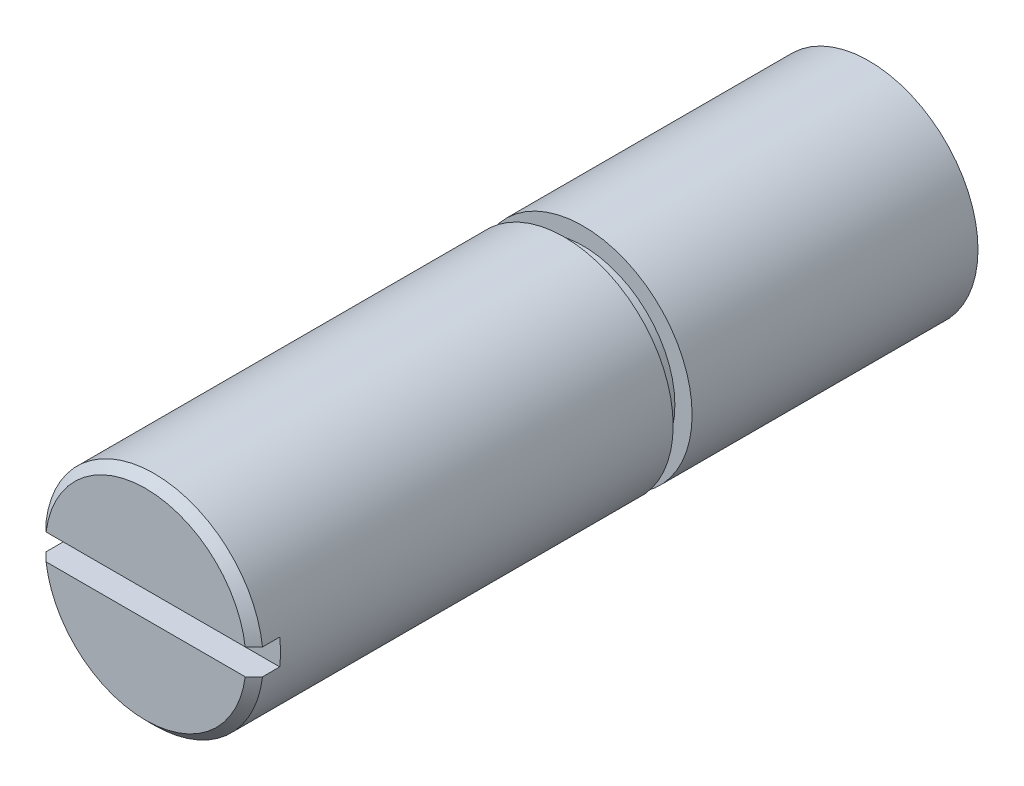
ISO-10303-21;
HEADER;
FILE_DESCRIPTION(('STEP AP214'),'2;1');
FILE_NAME('part.step','',(''),(''),'','','');
FILE_SCHEMA(('AUTOMOTIVE_DESIGN { 1 0 10303 214 1 1 1 1 }'));
ENDSEC;
DATA;
#1=APPLICATION_CONTEXT('core data for automotive mechanical design processes');
#2=APPLICATION_PROTOCOL_DEFINITION('international standard','automotive_design',2000,#1);
#3=PRODUCT_CONTEXT('',#1,'mechanical');
#4=PRODUCT('Part','Part','',(#3));
#5=PRODUCT_RELATED_PRODUCT_CATEGORY('part','',(#4));
#6=PRODUCT_DEFINITION_FORMATION('','',#4);
#7=PRODUCT_DEFINITION_CONTEXT('part definition',#1,'design');
#8=PRODUCT_DEFINITION('design','',#6,#7);
#9=PRODUCT_DEFINITION_SHAPE('','',#8);
#10=(LENGTH_UNIT() NAMED_UNIT(*) SI_UNIT(.MILLI.,.METRE.));
#11=(NAMED_UNIT(*) PLANE_ANGLE_UNIT() SI_UNIT($,.RADIAN.));
#12=(NAMED_UNIT(*) SI_UNIT($,.STERADIAN.) SOLID_ANGLE_UNIT());
#13=UNCERTAINTY_MEASURE_WITH_UNIT(LENGTH_MEASURE(1.E-05),#10,'distance_accuracy_value','');
#14=(GEOMETRIC_REPRESENTATION_CONTEXT(3) GLOBAL_UNCERTAINTY_ASSIGNED_CONTEXT((#13)) GLOBAL_UNIT_ASSIGNED_CONTEXT((#10,
#11,#12)) REPRESENTATION_CONTEXT('',''));
#15=CARTESIAN_POINT('',(0.,0.,0.));
#16=DIRECTION('',(0.,0.,1.));
#17=DIRECTION('',(1.,0.,0.));
#18=AXIS2_PLACEMENT_3D('',#15,#16,#17);
#19=CARTESIAN_POINT('',(0.,0.,0.));
#20=DIRECTION('',(0.,0.,-1.));
#21=DIRECTION('',(0.,-1.,0.));
#22=AXIS2_PLACEMENT_3D('',#19,#20,#21);
#23=PLANE('',#22);
#24=CARTESIAN_POINT('',(0.,0.,0.));
#25=DIRECTION('',(0.,0.,-1.));
#26=DIRECTION('',(-1.,0.,0.));
#27=AXIS2_PLACEMENT_3D('',#24,#25,#26);
#28=CIRCLE('',#27,3.165);
#29=CARTESIAN_POINT('',(3.165,0.,0.));
#30=VERTEX_POINT('',#29);
#31=EDGE_CURVE('E145',#30,#30,#28,.T.);
#32=ORIENTED_EDGE('',*,*,#31,.T.);
#33=EDGE_LOOP('',(#32));
#34=FACE_BOUND('',#33,.T.);
#35=ADVANCED_FACE('F16',(#34),#23,.T.);
#36=CARTESIAN_POINT('',(0.,0.,0.));
#37=DIRECTION('',(0.,0.,1.));
#38=DIRECTION('',(-1.,0.,0.));
#39=AXIS2_PLACEMENT_3D('',#36,#37,#38);
#40=CYLINDRICAL_SURFACE('',#39,3.165);
#41=DIRECTION('',(0.,0.,1.));
#42=VECTOR('',#41,1.);
#43=CARTESIAN_POINT('',(3.14270584051387,-0.375,20.25));
#44=LINE('',#43,#42);
#45=CARTESIAN_POINT('',(3.14270584051387,-0.375,20.25));
#46=VERTEX_POINT('',#45);
#47=CARTESIAN_POINT('',(3.14270584051387,-0.375,20.75));
#48=VERTEX_POINT('',#47);
#49=EDGE_CURVE('E101',#46,#48,#44,.T.);
#50=ORIENTED_EDGE('',*,*,#49,.T.);
#51=CARTESIAN_POINT('',(0.,0.,20.75));
#52=DIRECTION('',(0.,0.,1.));
#53=DIRECTION('',(-1.,0.,0.));
#54=AXIS2_PLACEMENT_3D('',#51,#52,#53);
#55=CIRCLE('',#54,3.165);
#56=CARTESIAN_POINT('',(-3.14270584051387,-0.375,20.75));
#57=VERTEX_POINT('',#56);
#58=EDGE_CURVE('E11',#57,#48,#55,.T.);
#59=ORIENTED_EDGE('',*,*,#58,.F.);
#60=DIRECTION('',(0.,0.,-1.));
#61=VECTOR('',#60,1.);
#62=CARTESIAN_POINT('',(-3.14270584051387,-0.375,20.75));
#63=LINE('',#62,#61);
#64=CARTESIAN_POINT('',(-3.14270584051387,-0.375,20.25));
#65=VERTEX_POINT('',#64);
#66=EDGE_CURVE('E98',#57,#65,#63,.T.);
#67=ORIENTED_EDGE('',*,*,#66,.T.);
#68=CARTESIAN_POINT('',(0.,0.,20.25));
#69=DIRECTION('',(0.,0.,-1.));
#70=DIRECTION('',(-1.,0.,0.));
#71=AXIS2_PLACEMENT_3D('',#68,#69,#70);
#72=CIRCLE('',#71,3.165);
#73=CARTESIAN_POINT('',(-3.14270584051387,0.375,20.25));
#74=VERTEX_POINT('',#73);
#75=EDGE_CURVE('E139',#65,#74,#72,.T.);
#76=ORIENTED_EDGE('',*,*,#75,.T.);
#77=DIRECTION('',(0.,0.,1.));
#78=VECTOR('',#77,1.);
#79=CARTESIAN_POINT('',(-3.14270584051387,0.375,20.25));
#80=LINE('',#79,#78);
#81=CARTESIAN_POINT('',(-3.14270584051387,0.375,20.75));
#82=VERTEX_POINT('',#81);
#83=EDGE_CURVE('E132',#74,#82,#80,.T.);
#84=ORIENTED_EDGE('',*,*,#83,.T.);
#85=CARTESIAN_POINT('',(0.,0.,20.75));
#86=DIRECTION('',(0.,0.,1.));
#87=DIRECTION('',(-1.,0.,0.));
#88=AXIS2_PLACEMENT_3D('',#85,#86,#87);
#89=CIRCLE('',#88,3.165);
#90=CARTESIAN_POINT('',(3.14270584051387,0.375,20.75));
#91=VERTEX_POINT('',#90);
#92=EDGE_CURVE('E27',#91,#82,#89,.T.);
#93=ORIENTED_EDGE('',*,*,#92,.F.);
#94=DIRECTION('',(0.,0.,-1.));
#95=VECTOR('',#94,1.);
#96=CARTESIAN_POINT('',(3.14270584051387,0.375,20.75));
#97=LINE('',#96,#95);
#98=CARTESIAN_POINT('',(3.14270584051387,0.375,20.25));
#99=VERTEX_POINT('',#98);
#100=EDGE_CURVE('E140',#91,#99,#97,.T.);
#101=ORIENTED_EDGE('',*,*,#100,.T.);
#102=CARTESIAN_POINT('',(0.,0.,20.25));
#103=DIRECTION('',(0.,0.,-1.));
#104=DIRECTION('',(-1.,0.,0.));
#105=AXIS2_PLACEMENT_3D('',#102,#103,#104);
#106=CIRCLE('',#105,3.165);
#107=EDGE_CURVE('E41',#99,#46,#106,.T.);
#108=ORIENTED_EDGE('',*,*,#107,.T.);
#109=EDGE_LOOP('',(#50,#59,#67,#76,#84,#93,#101,#108));
#110=FACE_BOUND('',#109,.T.);
#111=CARTESIAN_POINT('',(0.,0.,8.85));
#112=DIRECTION('',(0.,0.,1.));
#113=DIRECTION('',(-1.,0.,0.));
#114=AXIS2_PLACEMENT_3D('',#111,#112,#113);
#115=CIRCLE('',#114,3.165);
#116=CARTESIAN_POINT('',(3.165,0.,8.85));
#117=VERTEX_POINT('',#116);
#118=EDGE_CURVE('E146',#117,#117,#115,.T.);
#119=ORIENTED_EDGE('',*,*,#118,.T.);
#120=EDGE_LOOP('',(#119));
#121=FACE_BOUND('',#120,.T.);
#122=ADVANCED_FACE('F95',(#110,#121),#40,.T.);
#123=CARTESIAN_POINT('',(0.,0.,20.875));
#124=DIRECTION('',(0.,0.,-1.));
#125=DIRECTION('',(-1.,0.,0.));
#126=AXIS2_PLACEMENT_3D('',#123,#124,#125);
#127=CONICAL_SURFACE('',#126,3.04,0.785398162500002);
#128=CARTESIAN_POINT('',(3.14270584051388,-0.375,20.75));
#129=CARTESIAN_POINT('',(3.011562712765,-0.375,20.8802193597218));
#130=CARTESIAN_POINT('',(2.8907784418734,-0.375,21.));
#131=(BOUNDED_CURVE() B_SPLINE_CURVE(2,(#128,#129,#130),.UNSPECIFIED.,.F.,
.F.) B_SPLINE_CURVE_WITH_KNOTS((3,3),(0.,0.035491888845036),
.UNSPECIFIED.) CURVE() GEOMETRIC_REPRESENTATION_ITEM() RATIONAL_B_SPLINE_CURVE((1.,
1.0008595541965,1.)) REPRESENTATION_ITEM(''));
#132=CARTESIAN_POINT('',(2.8907784418734,-0.375,21.));
#133=VERTEX_POINT('',#132);
#134=EDGE_CURVE('E165',#48,#133,#131,.T.);
#135=ORIENTED_EDGE('',*,*,#134,.T.);
#136=CARTESIAN_POINT('',(0.,0.,21.));
#137=DIRECTION('',(0.,0.,-1.));
#138=DIRECTION('',(-1.,0.,0.));
#139=AXIS2_PLACEMENT_3D('',#136,#137,#138);
#140=CIRCLE('',#139,2.915);
#141=CARTESIAN_POINT('',(-2.8907784418734,-0.375,21.));
#142=VERTEX_POINT('',#141);
#143=EDGE_CURVE('E20',#133,#142,#140,.T.);
#144=ORIENTED_EDGE('',*,*,#143,.T.);
#145=CARTESIAN_POINT('',(-2.8907784418734,-0.375,21.));
#146=CARTESIAN_POINT('',(-3.011562712765,-0.375,20.8802193597218));
#147=CARTESIAN_POINT('',(-3.14270584051388,-0.375,20.75));
#148=(BOUNDED_CURVE() B_SPLINE_CURVE(2,(#145,#146,#147),.UNSPECIFIED.,.F.,
.F.) B_SPLINE_CURVE_WITH_KNOTS((3,3),(0.,0.035491888845036),
.UNSPECIFIED.) CURVE() GEOMETRIC_REPRESENTATION_ITEM() RATIONAL_B_SPLINE_CURVE((1.,
1.0008595541965,1.)) REPRESENTATION_ITEM(''));
#149=EDGE_CURVE('E106',#142,#57,#148,.T.);
#150=ORIENTED_EDGE('',*,*,#149,.T.);
#151=ORIENTED_EDGE('',*,*,#58,.T.);
#152=EDGE_LOOP('',(#135,#144,#150,#151));
#153=FACE_BOUND('',#152,.T.);
#154=ADVANCED_FACE('F107',(#153),#127,.T.);
#155=CARTESIAN_POINT('',(0.,0.,20.875));
#156=DIRECTION('',(0.,0.,-1.));
#157=DIRECTION('',(-1.,0.,0.));
#158=AXIS2_PLACEMENT_3D('',#155,#156,#157);
#159=CONICAL_SURFACE('',#158,3.04,0.785398162500002);
#160=CARTESIAN_POINT('',(2.8907784418734,0.375,21.));
#161=CARTESIAN_POINT('',(3.011562712765,0.375,20.8802193597218));
#162=CARTESIAN_POINT('',(3.14270584051388,0.375,20.75));
#163=(BOUNDED_CURVE() B_SPLINE_CURVE(2,(#160,#161,#162),.UNSPECIFIED.,.F.,
.F.) B_SPLINE_CURVE_WITH_KNOTS((3,3),(0.,0.035491888845036),
.UNSPECIFIED.) CURVE() GEOMETRIC_REPRESENTATION_ITEM() RATIONAL_B_SPLINE_CURVE((1.,
1.0008595541965,1.)) REPRESENTATION_ITEM(''));
#164=CARTESIAN_POINT('',(2.8907784418734,0.375,21.));
#165=VERTEX_POINT('',#164);
#166=EDGE_CURVE('E148',#165,#91,#163,.T.);
#167=ORIENTED_EDGE('',*,*,#166,.T.);
#168=ORIENTED_EDGE('',*,*,#92,.T.);
#169=CARTESIAN_POINT('',(-3.14270584051388,0.375,20.75));
#170=CARTESIAN_POINT('',(-3.011562712765,0.375,20.8802193597218));
#171=CARTESIAN_POINT('',(-2.8907784418734,0.375,21.));
#172=(BOUNDED_CURVE() B_SPLINE_CURVE(2,(#169,#170,#171),.UNSPECIFIED.,.F.,
.F.) B_SPLINE_CURVE_WITH_KNOTS((3,3),(0.,0.035491888845036),
.UNSPECIFIED.) CURVE() GEOMETRIC_REPRESENTATION_ITEM() RATIONAL_B_SPLINE_CURVE((1.,
1.0008595541965,1.)) REPRESENTATION_ITEM(''));
#173=CARTESIAN_POINT('',(-2.8907784418734,0.375,21.));
#174=VERTEX_POINT('',#173);
#175=EDGE_CURVE('E127',#82,#174,#172,.T.);
#176=ORIENTED_EDGE('',*,*,#175,.T.);
#177=CARTESIAN_POINT('',(0.,0.,21.));
#178=DIRECTION('',(0.,0.,-1.));
#179=DIRECTION('',(-1.,0.,0.));
#180=AXIS2_PLACEMENT_3D('',#177,#178,#179);
#181=CIRCLE('',#180,2.915);
#182=EDGE_CURVE('E64',#174,#165,#181,.T.);
#183=ORIENTED_EDGE('',*,*,#182,.T.);
#184=EDGE_LOOP('',(#167,#168,#176,#183));
#185=FACE_BOUND('',#184,.T.);
#186=ADVANCED_FACE('F295',(#185),#159,.T.);
#187=CARTESIAN_POINT('',(0.,0.,21.));
#188=DIRECTION('',(0.,0.,-1.));
#189=DIRECTION('',(0.,-1.,0.));
#190=AXIS2_PLACEMENT_3D('',#187,#188,#189);
#191=PLANE('',#190);
#192=DIRECTION('',(-1.,0.,0.));
#193=VECTOR('',#192,1.);
#194=CARTESIAN_POINT('',(2.8907784418734,-0.375,21.));
#195=LINE('',#194,#193);
#196=EDGE_CURVE('E112',#133,#142,#195,.T.);
#197=ORIENTED_EDGE('',*,*,#196,.T.);
#198=ORIENTED_EDGE('',*,*,#143,.F.);
#199=EDGE_LOOP('',(#197,#198));
#200=FACE_BOUND('',#199,.T.);
#201=ADVANCED_FACE('F285',(#200),#191,.F.);
#202=CARTESIAN_POINT('',(0.,0.,21.));
#203=DIRECTION('',(0.,0.,-1.));
#204=DIRECTION('',(0.,-1.,0.));
#205=AXIS2_PLACEMENT_3D('',#202,#203,#204);
#206=PLANE('',#205);
#207=DIRECTION('',(1.,0.,0.));
#208=VECTOR('',#207,1.);
#209=CARTESIAN_POINT('',(-2.8907784418734,0.375,21.));
#210=LINE('',#209,#208);
#211=EDGE_CURVE('E133',#174,#165,#210,.T.);
#212=ORIENTED_EDGE('',*,*,#211,.T.);
#213=ORIENTED_EDGE('',*,*,#182,.F.);
#214=EDGE_LOOP('',(#212,#213));
#215=FACE_BOUND('',#214,.T.);
#216=ADVANCED_FACE('F276',(#215),#206,.F.);
#217=CARTESIAN_POINT('',(0.,0.,20.25));
#218=DIRECTION('',(0.,0.,1.));
#219=DIRECTION('',(1.,0.,0.));
#220=AXIS2_PLACEMENT_3D('',#217,#218,#219);
#221=PLANE('',#220);
#222=DIRECTION('',(1.,0.,0.));
#223=VECTOR('',#222,1.);
#224=CARTESIAN_POINT('',(-3.14270584051387,-0.375,20.25));
#225=LINE('',#224,#223);
#226=EDGE_CURVE('E115',#65,#46,#225,.T.);
#227=ORIENTED_EDGE('',*,*,#226,.T.);
#228=ORIENTED_EDGE('',*,*,#107,.F.);
#229=DIRECTION('',(-1.,0.,0.));
#230=VECTOR('',#229,1.);
#231=CARTESIAN_POINT('',(3.14270584051387,0.375,20.25));
#232=LINE('',#231,#230);
#233=EDGE_CURVE('E125',#99,#74,#232,.T.);
#234=ORIENTED_EDGE('',*,*,#233,.T.);
#235=ORIENTED_EDGE('',*,*,#75,.F.);
#236=EDGE_LOOP('',(#227,#228,#234,#235));
#237=FACE_BOUND('',#236,.T.);
#238=ADVANCED_FACE('F265',(#237),#221,.T.);
#239=CARTESIAN_POINT('',(3.14270584051387,0.375,21.));
#240=DIRECTION('',(0.,1.,0.));
#241=DIRECTION('',(1.,0.,0.));
#242=AXIS2_PLACEMENT_3D('',#239,#240,#241);
#243=PLANE('',#242);
#244=ORIENTED_EDGE('',*,*,#166,.F.);
#245=ORIENTED_EDGE('',*,*,#211,.F.);
#246=ORIENTED_EDGE('',*,*,#175,.F.);
#247=ORIENTED_EDGE('',*,*,#83,.F.);
#248=ORIENTED_EDGE('',*,*,#233,.F.);
#249=ORIENTED_EDGE('',*,*,#100,.F.);
#250=EDGE_LOOP('',(#244,#245,#246,#247,#248,#249));
#251=FACE_BOUND('',#250,.T.);
#252=ADVANCED_FACE('F254',(#251),#243,.F.);
#253=CARTESIAN_POINT('',(-3.14270584051387,-0.375,21.));
#254=DIRECTION('',(0.,-1.,0.));
#255=DIRECTION('',(0.,0.,-1.));
#256=AXIS2_PLACEMENT_3D('',#253,#254,#255);
#257=PLANE('',#256);
#258=ORIENTED_EDGE('',*,*,#134,.F.);
#259=ORIENTED_EDGE('',*,*,#49,.F.);
#260=ORIENTED_EDGE('',*,*,#226,.F.);
#261=ORIENTED_EDGE('',*,*,#66,.F.);
#262=ORIENTED_EDGE('',*,*,#149,.F.);
#263=ORIENTED_EDGE('',*,*,#196,.F.);
#264=EDGE_LOOP('',(#258,#259,#260,#261,#262,#263));
#265=FACE_BOUND('',#264,.T.);
#266=ADVANCED_FACE('F114',(#265),#257,.F.);
#267=CARTESIAN_POINT('',(0.,0.,0.));
#268=DIRECTION('',(0.,0.,1.));
#269=DIRECTION('',(-1.,0.,0.));
#270=AXIS2_PLACEMENT_3D('',#267,#268,#269);
#271=CYLINDRICAL_SURFACE('',#270,3.165);
#272=CARTESIAN_POINT('',(0.,0.,8.3));
#273=DIRECTION('',(0.,0.,-1.));
#274=DIRECTION('',(-1.,0.,0.));
#275=AXIS2_PLACEMENT_3D('',#272,#273,#274);
#276=CIRCLE('',#275,3.165);
#277=CARTESIAN_POINT('',(3.165,0.,8.3));
#278=VERTEX_POINT('',#277);
#279=EDGE_CURVE('E141',#278,#278,#276,.T.);
#280=ORIENTED_EDGE('',*,*,#279,.T.);
#281=EDGE_LOOP('',(#280));
#282=FACE_BOUND('',#281,.T.);
#283=ORIENTED_EDGE('',*,*,#31,.F.);
#284=EDGE_LOOP('',(#283));
#285=FACE_BOUND('',#284,.T.);
#286=ADVANCED_FACE('F18',(#282,#285),#271,.T.);
#287=CARTESIAN_POINT('',(0.,0.,8.3));
#288=DIRECTION('',(0.,0.,-1.));
#289=DIRECTION('',(0.,-1.,0.));
#290=AXIS2_PLACEMENT_3D('',#287,#288,#289);
#291=PLANE('',#290);
#292=CARTESIAN_POINT('',(0.,0.,8.3));
#293=DIRECTION('',(0.,0.,1.));
#294=DIRECTION('',(-1.,0.,0.));
#295=AXIS2_PLACEMENT_3D('',#292,#293,#294);
#296=CIRCLE('',#295,2.665);
#297=CARTESIAN_POINT('',(2.665,0.,8.3));
#298=VERTEX_POINT('',#297);
#299=EDGE_CURVE('E152',#298,#298,#296,.T.);
#300=ORIENTED_EDGE('',*,*,#299,.F.);
#301=EDGE_LOOP('',(#300));
#302=FACE_BOUND('',#301,.T.);
#303=ORIENTED_EDGE('',*,*,#279,.F.);
#304=EDGE_LOOP('',(#303));
#305=FACE_BOUND('',#304,.T.);
#306=ADVANCED_FACE('F222',(#302,#305),#291,.F.);
#307=CARTESIAN_POINT('',(0.,0.,8.85));
#308=DIRECTION('',(0.,0.,-1.));
#309=DIRECTION('',(0.,-1.,0.));
#310=AXIS2_PLACEMENT_3D('',#307,#308,#309);
#311=PLANE('',#310);
#312=CARTESIAN_POINT('',(0.,0.,8.85));
#313=DIRECTION('',(0.,0.,-1.));
#314=DIRECTION('',(-1.,0.,0.));
#315=AXIS2_PLACEMENT_3D('',#312,#313,#314);
#316=CIRCLE('',#315,2.665);
#317=CARTESIAN_POINT('',(2.665,0.,8.85));
#318=VERTEX_POINT('',#317);
#319=EDGE_CURVE('E159',#318,#318,#316,.T.);
#320=ORIENTED_EDGE('',*,*,#319,.F.);
#321=EDGE_LOOP('',(#320));
#322=FACE_BOUND('',#321,.T.);
#323=ORIENTED_EDGE('',*,*,#118,.F.);
#324=EDGE_LOOP('',(#323));
#325=FACE_BOUND('',#324,.T.);
#326=ADVANCED_FACE('F208',(#322,#325),#311,.T.);
#327=CARTESIAN_POINT('',(0.,0.,8.3));
#328=DIRECTION('',(0.,0.,1.));
#329=DIRECTION('',(-1.,0.,0.));
#330=AXIS2_PLACEMENT_3D('',#327,#328,#329);
#331=CYLINDRICAL_SURFACE('',#330,2.665);
#332=ORIENTED_EDGE('',*,*,#299,.T.);
#333=EDGE_LOOP('',(#332));
#334=FACE_BOUND('',#333,.T.);
#335=ORIENTED_EDGE('',*,*,#319,.T.);
#336=EDGE_LOOP('',(#335));
#337=FACE_BOUND('',#336,.T.);
#338=ADVANCED_FACE('F202',(#334,#337),#331,.T.);
#339=CLOSED_SHELL('',(#35,#122,#154,#186,#201,#216,#238,#252,#266,#286,#306,#326,#338));
#340=MANIFOLD_SOLID_BREP('B1',#339);
#341=ADVANCED_BREP_SHAPE_REPRESENTATION('',(#18,#340),#14);
#342=SHAPE_DEFINITION_REPRESENTATION(#9,#341);
ENDSEC;
END-ISO-10303-21;
